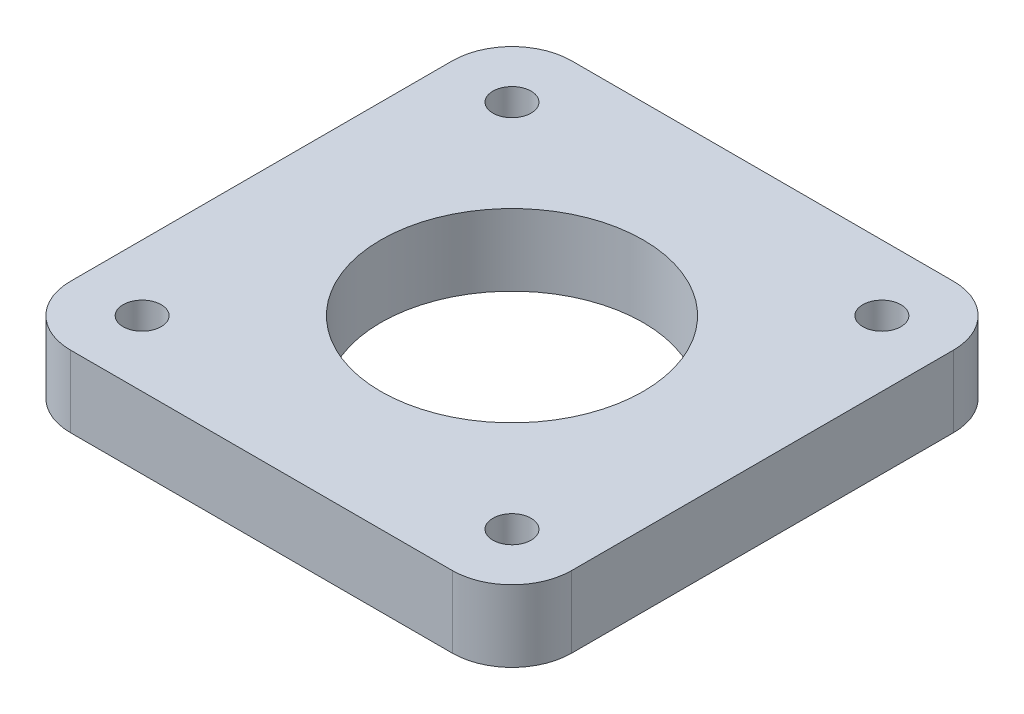
ISO-10303-21;
HEADER;
FILE_DESCRIPTION(('STEP AP214'),'2;1');
FILE_NAME('part.step','',(''),(''),'','','');
FILE_SCHEMA(('AUTOMOTIVE_DESIGN { 1 0 10303 214 1 1 1 1 }'));
ENDSEC;
DATA;
#1=APPLICATION_CONTEXT('core data for automotive mechanical design processes');
#2=APPLICATION_PROTOCOL_DEFINITION('international standard','automotive_design',2000,#1);
#3=PRODUCT_CONTEXT('',#1,'mechanical');
#4=PRODUCT('Part','Part','',(#3));
#5=PRODUCT_RELATED_PRODUCT_CATEGORY('part','',(#4));
#6=PRODUCT_DEFINITION_FORMATION('','',#4);
#7=PRODUCT_DEFINITION_CONTEXT('part definition',#1,'design');
#8=PRODUCT_DEFINITION('design','',#6,#7);
#9=PRODUCT_DEFINITION_SHAPE('','',#8);
#10=(LENGTH_UNIT() NAMED_UNIT(*) SI_UNIT(.MILLI.,.METRE.));
#11=(NAMED_UNIT(*) PLANE_ANGLE_UNIT() SI_UNIT($,.RADIAN.));
#12=(NAMED_UNIT(*) SI_UNIT($,.STERADIAN.) SOLID_ANGLE_UNIT());
#13=UNCERTAINTY_MEASURE_WITH_UNIT(LENGTH_MEASURE(1.E-05),#10,'distance_accuracy_value','');
#14=(GEOMETRIC_REPRESENTATION_CONTEXT(3) GLOBAL_UNCERTAINTY_ASSIGNED_CONTEXT((#13)) GLOBAL_UNIT_ASSIGNED_CONTEXT((#10,
#11,#12)) REPRESENTATION_CONTEXT('',''));
#15=CARTESIAN_POINT('',(0.,0.,0.));
#16=DIRECTION('',(0.,0.,1.));
#17=DIRECTION('',(1.,0.,0.));
#18=AXIS2_PLACEMENT_3D('',#15,#16,#17);
#19=CARTESIAN_POINT('',(21.,6.,-21.));
#20=DIRECTION('',(-1.,0.,0.));
#21=DIRECTION('',(0.,0.,1.));
#22=AXIS2_PLACEMENT_3D('',#19,#20,#21);
#23=PLANE('',#22);
#24=DIRECTION('',(0.,0.,-1.));
#25=VECTOR('',#24,1.);
#26=CARTESIAN_POINT('',(21.,6.,-21.));
#27=LINE('',#26,#25);
#28=CARTESIAN_POINT('',(21.,6.,16.));
#29=VERTEX_POINT('',#28);
#30=CARTESIAN_POINT('',(21.,6.,-16.));
#31=VERTEX_POINT('',#30);
#32=EDGE_CURVE('E118',#29,#31,#27,.T.);
#33=ORIENTED_EDGE('',*,*,#32,.F.);
#34=DIRECTION('',(0.,-1.,0.));
#35=VECTOR('',#34,1.);
#36=CARTESIAN_POINT('',(21.,6.,16.));
#37=LINE('',#36,#35);
#38=CARTESIAN_POINT('',(21.,0.,16.));
#39=VERTEX_POINT('',#38);
#40=EDGE_CURVE('E103',#29,#39,#37,.T.);
#41=ORIENTED_EDGE('',*,*,#40,.T.);
#42=DIRECTION('',(0.,0.,-1.));
#43=VECTOR('',#42,1.);
#44=CARTESIAN_POINT('',(21.,0.,-21.));
#45=LINE('',#44,#43);
#46=CARTESIAN_POINT('',(21.,0.,-16.));
#47=VERTEX_POINT('',#46);
#48=EDGE_CURVE('E115',#39,#47,#45,.T.);
#49=ORIENTED_EDGE('',*,*,#48,.T.);
#50=DIRECTION('',(0.,-1.,0.));
#51=VECTOR('',#50,1.);
#52=CARTESIAN_POINT('',(21.,6.,-16.));
#53=LINE('',#52,#51);
#54=EDGE_CURVE('E120',#47,#31,#53,.F.);
#55=ORIENTED_EDGE('',*,*,#54,.T.);
#56=EDGE_LOOP('',(#33,#41,#49,#55));
#57=FACE_BOUND('',#56,.T.);
#58=ADVANCED_FACE('F33',(#57),#23,.F.);
#59=CARTESIAN_POINT('',(-21.,6.,-21.));
#60=DIRECTION('',(0.,0.,1.));
#61=DIRECTION('',(1.,0.,0.));
#62=AXIS2_PLACEMENT_3D('',#59,#60,#61);
#63=PLANE('',#62);
#64=DIRECTION('',(-1.,0.,0.));
#65=VECTOR('',#64,1.);
#66=CARTESIAN_POINT('',(-21.,0.,-21.));
#67=LINE('',#66,#65);
#68=CARTESIAN_POINT('',(16.,0.,-21.));
#69=VERTEX_POINT('',#68);
#70=CARTESIAN_POINT('',(-16.,0.,-21.));
#71=VERTEX_POINT('',#70);
#72=EDGE_CURVE('E125',#69,#71,#67,.T.);
#73=ORIENTED_EDGE('',*,*,#72,.T.);
#74=DIRECTION('',(0.,-1.,0.));
#75=VECTOR('',#74,1.);
#76=CARTESIAN_POINT('',(-16.,6.,-21.));
#77=LINE('',#76,#75);
#78=CARTESIAN_POINT('',(-16.,6.,-21.));
#79=VERTEX_POINT('',#78);
#80=EDGE_CURVE('E11',#71,#79,#77,.F.);
#81=ORIENTED_EDGE('',*,*,#80,.T.);
#82=DIRECTION('',(-1.,0.,0.));
#83=VECTOR('',#82,1.);
#84=CARTESIAN_POINT('',(-21.,6.,-21.));
#85=LINE('',#84,#83);
#86=CARTESIAN_POINT('',(16.,6.,-21.));
#87=VERTEX_POINT('',#86);
#88=EDGE_CURVE('E164',#87,#79,#85,.T.);
#89=ORIENTED_EDGE('',*,*,#88,.F.);
#90=DIRECTION('',(0.,-1.,0.));
#91=VECTOR('',#90,1.);
#92=CARTESIAN_POINT('',(16.,6.,-21.));
#93=LINE('',#92,#91);
#94=EDGE_CURVE('E41',#87,#69,#93,.T.);
#95=ORIENTED_EDGE('',*,*,#94,.T.);
#96=EDGE_LOOP('',(#73,#81,#89,#95));
#97=FACE_BOUND('',#96,.T.);
#98=ADVANCED_FACE('F162',(#97),#63,.F.);
#99=CARTESIAN_POINT('',(-21.,6.,-21.));
#100=DIRECTION('',(1.,0.,0.));
#101=DIRECTION('',(0.,0.,-1.));
#102=AXIS2_PLACEMENT_3D('',#99,#100,#101);
#103=PLANE('',#102);
#104=DIRECTION('',(0.,0.,1.));
#105=VECTOR('',#104,1.);
#106=CARTESIAN_POINT('',(-21.,6.,-21.));
#107=LINE('',#106,#105);
#108=CARTESIAN_POINT('',(-21.,6.,-16.));
#109=VERTEX_POINT('',#108);
#110=CARTESIAN_POINT('',(-21.,6.,16.));
#111=VERTEX_POINT('',#110);
#112=EDGE_CURVE('E172',#109,#111,#107,.T.);
#113=ORIENTED_EDGE('',*,*,#112,.F.);
#114=DIRECTION('',(0.,-1.,0.));
#115=VECTOR('',#114,1.);
#116=CARTESIAN_POINT('',(-21.,6.,-16.));
#117=LINE('',#116,#115);
#118=CARTESIAN_POINT('',(-21.,0.,-16.));
#119=VERTEX_POINT('',#118);
#120=EDGE_CURVE('E156',#109,#119,#117,.T.);
#121=ORIENTED_EDGE('',*,*,#120,.T.);
#122=DIRECTION('',(0.,0.,1.));
#123=VECTOR('',#122,1.);
#124=CARTESIAN_POINT('',(-21.,0.,-21.));
#125=LINE('',#124,#123);
#126=CARTESIAN_POINT('',(-21.,0.,16.));
#127=VERTEX_POINT('',#126);
#128=EDGE_CURVE('E129',#119,#127,#125,.T.);
#129=ORIENTED_EDGE('',*,*,#128,.T.);
#130=DIRECTION('',(0.,-1.,0.));
#131=VECTOR('',#130,1.);
#132=CARTESIAN_POINT('',(-21.,6.,16.));
#133=LINE('',#132,#131);
#134=EDGE_CURVE('E48',#127,#111,#133,.F.);
#135=ORIENTED_EDGE('',*,*,#134,.T.);
#136=EDGE_LOOP('',(#113,#121,#129,#135));
#137=FACE_BOUND('',#136,.T.);
#138=ADVANCED_FACE('F171',(#137),#103,.F.);
#139=CARTESIAN_POINT('',(-21.,6.,21.));
#140=DIRECTION('',(0.,0.,-1.));
#141=DIRECTION('',(-1.,0.,0.));
#142=AXIS2_PLACEMENT_3D('',#139,#140,#141);
#143=PLANE('',#142);
#144=DIRECTION('',(1.,0.,0.));
#145=VECTOR('',#144,1.);
#146=CARTESIAN_POINT('',(-21.,0.,21.));
#147=LINE('',#146,#145);
#148=CARTESIAN_POINT('',(-16.,0.,21.));
#149=VERTEX_POINT('',#148);
#150=CARTESIAN_POINT('',(16.,0.,21.));
#151=VERTEX_POINT('',#150);
#152=EDGE_CURVE('E139',#149,#151,#147,.T.);
#153=ORIENTED_EDGE('',*,*,#152,.T.);
#154=DIRECTION('',(0.,-1.,0.));
#155=VECTOR('',#154,1.);
#156=CARTESIAN_POINT('',(16.,6.,21.));
#157=LINE('',#156,#155);
#158=CARTESIAN_POINT('',(16.,6.,21.));
#159=VERTEX_POINT('',#158);
#160=EDGE_CURVE('E104',#151,#159,#157,.F.);
#161=ORIENTED_EDGE('',*,*,#160,.T.);
#162=DIRECTION('',(1.,0.,0.));
#163=VECTOR('',#162,1.);
#164=CARTESIAN_POINT('',(-21.,6.,21.));
#165=LINE('',#164,#163);
#166=CARTESIAN_POINT('',(-16.,6.,21.));
#167=VERTEX_POINT('',#166);
#168=EDGE_CURVE('E135',#167,#159,#165,.T.);
#169=ORIENTED_EDGE('',*,*,#168,.F.);
#170=DIRECTION('',(0.,-1.,0.));
#171=VECTOR('',#170,1.);
#172=CARTESIAN_POINT('',(-16.,6.,21.));
#173=LINE('',#172,#171);
#174=EDGE_CURVE('E109',#167,#149,#173,.T.);
#175=ORIENTED_EDGE('',*,*,#174,.T.);
#176=EDGE_LOOP('',(#153,#161,#169,#175));
#177=FACE_BOUND('',#176,.T.);
#178=ADVANCED_FACE('F261',(#177),#143,.F.);
#179=CARTESIAN_POINT('',(0.,6.,0.));
#180=DIRECTION('',(0.,1.,0.));
#181=DIRECTION('',(0.,0.,1.));
#182=AXIS2_PLACEMENT_3D('',#179,#180,#181);
#183=PLANE('',#182);
#184=CARTESIAN_POINT('',(0.,6.00000000000001,0.));
#185=DIRECTION('',(0.,-1.,0.));
#186=DIRECTION('',(0.,0.,-1.));
#187=AXIS2_PLACEMENT_3D('',#184,#185,#186);
#188=CIRCLE('',#187,11.);
#189=CARTESIAN_POINT('',(0.,6.00000000000001,-11.));
#190=VERTEX_POINT('',#189);
#191=EDGE_CURVE('E198',#190,#190,#188,.T.);
#192=ORIENTED_EDGE('',*,*,#191,.T.);
#193=EDGE_LOOP('',(#192));
#194=FACE_BOUND('',#193,.T.);
#195=CARTESIAN_POINT('',(-15.5,6.00000000000001,-15.5));
#196=DIRECTION('',(0.,-1.,0.));
#197=DIRECTION('',(0.,0.,-1.));
#198=AXIS2_PLACEMENT_3D('',#195,#196,#197);
#199=CIRCLE('',#198,1.59999999999999);
#200=CARTESIAN_POINT('',(-15.5,6.00000000000001,-17.1));
#201=VERTEX_POINT('',#200);
#202=EDGE_CURVE('E192',#201,#201,#199,.T.);
#203=ORIENTED_EDGE('',*,*,#202,.T.);
#204=EDGE_LOOP('',(#203));
#205=FACE_BOUND('',#204,.T.);
#206=CARTESIAN_POINT('',(-15.5,6.00000000000001,15.5));
#207=DIRECTION('',(0.,-1.,0.));
#208=DIRECTION('',(0.,0.,-1.));
#209=AXIS2_PLACEMENT_3D('',#206,#207,#208);
#210=CIRCLE('',#209,1.59999999999999);
#211=CARTESIAN_POINT('',(-15.5,6.00000000000001,13.9));
#212=VERTEX_POINT('',#211);
#213=EDGE_CURVE('E186',#212,#212,#210,.T.);
#214=ORIENTED_EDGE('',*,*,#213,.T.);
#215=EDGE_LOOP('',(#214));
#216=FACE_BOUND('',#215,.T.);
#217=CARTESIAN_POINT('',(15.5,6.00000000000001,15.5));
#218=DIRECTION('',(0.,-1.,0.));
#219=DIRECTION('',(0.,0.,-1.));
#220=AXIS2_PLACEMENT_3D('',#217,#218,#219);
#221=CIRCLE('',#220,1.59999999999999);
#222=CARTESIAN_POINT('',(15.5,6.00000000000001,13.9));
#223=VERTEX_POINT('',#222);
#224=EDGE_CURVE('E180',#223,#223,#221,.T.);
#225=ORIENTED_EDGE('',*,*,#224,.T.);
#226=EDGE_LOOP('',(#225));
#227=FACE_BOUND('',#226,.T.);
#228=CARTESIAN_POINT('',(15.5,6.00000000000001,-15.5));
#229=DIRECTION('',(0.,-1.,0.));
#230=DIRECTION('',(0.,0.,-1.));
#231=AXIS2_PLACEMENT_3D('',#228,#229,#230);
#232=CIRCLE('',#231,1.59999999999999);
#233=CARTESIAN_POINT('',(15.5,6.00000000000001,-17.1));
#234=VERTEX_POINT('',#233);
#235=EDGE_CURVE('E126',#234,#234,#232,.T.);
#236=ORIENTED_EDGE('',*,*,#235,.T.);
#237=EDGE_LOOP('',(#236));
#238=FACE_BOUND('',#237,.T.);
#239=ORIENTED_EDGE('',*,*,#168,.T.);
#240=CARTESIAN_POINT('',(16.,6.,16.));
#241=DIRECTION('',(0.,1.,0.));
#242=DIRECTION('',(0.,0.,1.));
#243=AXIS2_PLACEMENT_3D('',#240,#241,#242);
#244=CIRCLE('',#243,5.);
#245=EDGE_CURVE('E153',#159,#29,#244,.T.);
#246=ORIENTED_EDGE('',*,*,#245,.T.);
#247=ORIENTED_EDGE('',*,*,#32,.T.);
#248=CARTESIAN_POINT('',(16.,6.,-16.));
#249=DIRECTION('',(0.,1.,0.));
#250=DIRECTION('',(0.,0.,1.));
#251=AXIS2_PLACEMENT_3D('',#248,#249,#250);
#252=CIRCLE('',#251,5.);
#253=EDGE_CURVE('E150',#31,#87,#252,.T.);
#254=ORIENTED_EDGE('',*,*,#253,.T.);
#255=ORIENTED_EDGE('',*,*,#88,.T.);
#256=CARTESIAN_POINT('',(-16.,6.,-16.));
#257=DIRECTION('',(0.,1.,0.));
#258=DIRECTION('',(0.,0.,1.));
#259=AXIS2_PLACEMENT_3D('',#256,#257,#258);
#260=CIRCLE('',#259,5.);
#261=EDGE_CURVE('E55',#79,#109,#260,.T.);
#262=ORIENTED_EDGE('',*,*,#261,.T.);
#263=ORIENTED_EDGE('',*,*,#112,.T.);
#264=CARTESIAN_POINT('',(-16.,6.,16.));
#265=DIRECTION('',(0.,1.,0.));
#266=DIRECTION('',(0.,0.,1.));
#267=AXIS2_PLACEMENT_3D('',#264,#265,#266);
#268=CIRCLE('',#267,5.);
#269=EDGE_CURVE('E148',#111,#167,#268,.T.);
#270=ORIENTED_EDGE('',*,*,#269,.T.);
#271=EDGE_LOOP('',(#239,#246,#247,#254,#255,#262,#263,#270));
#272=FACE_BOUND('',#271,.T.);
#273=ADVANCED_FACE('F205',(#194,#205,#216,#227,#238,#272),#183,.T.);
#274=CARTESIAN_POINT('',(0.,0.,0.));
#275=DIRECTION('',(0.,1.,0.));
#276=DIRECTION('',(0.,0.,1.));
#277=AXIS2_PLACEMENT_3D('',#274,#275,#276);
#278=PLANE('',#277);
#279=CARTESIAN_POINT('',(0.,0.,0.));
#280=DIRECTION('',(0.,-1.,0.));
#281=DIRECTION('',(0.,0.,-1.));
#282=AXIS2_PLACEMENT_3D('',#279,#280,#281);
#283=CIRCLE('',#282,11.);
#284=CARTESIAN_POINT('',(0.,0.,-11.));
#285=VERTEX_POINT('',#284);
#286=EDGE_CURVE('E199',#285,#285,#283,.T.);
#287=ORIENTED_EDGE('',*,*,#286,.F.);
#288=EDGE_LOOP('',(#287));
#289=FACE_BOUND('',#288,.T.);
#290=CARTESIAN_POINT('',(-15.5,0.,-15.5));
#291=DIRECTION('',(0.,-1.,0.));
#292=DIRECTION('',(0.,0.,-1.));
#293=AXIS2_PLACEMENT_3D('',#290,#291,#292);
#294=CIRCLE('',#293,1.59999999999999);
#295=CARTESIAN_POINT('',(-15.5,0.,-17.1));
#296=VERTEX_POINT('',#295);
#297=EDGE_CURVE('E195',#296,#296,#294,.T.);
#298=ORIENTED_EDGE('',*,*,#297,.F.);
#299=EDGE_LOOP('',(#298));
#300=FACE_BOUND('',#299,.T.);
#301=CARTESIAN_POINT('',(-15.5,0.,15.5));
#302=DIRECTION('',(0.,-1.,0.));
#303=DIRECTION('',(0.,0.,-1.));
#304=AXIS2_PLACEMENT_3D('',#301,#302,#303);
#305=CIRCLE('',#304,1.59999999999999);
#306=CARTESIAN_POINT('',(-15.5,0.,13.9));
#307=VERTEX_POINT('',#306);
#308=EDGE_CURVE('E189',#307,#307,#305,.T.);
#309=ORIENTED_EDGE('',*,*,#308,.F.);
#310=EDGE_LOOP('',(#309));
#311=FACE_BOUND('',#310,.T.);
#312=CARTESIAN_POINT('',(15.5,0.,15.5));
#313=DIRECTION('',(0.,-1.,0.));
#314=DIRECTION('',(0.,0.,-1.));
#315=AXIS2_PLACEMENT_3D('',#312,#313,#314);
#316=CIRCLE('',#315,1.59999999999999);
#317=CARTESIAN_POINT('',(15.5,0.,13.9));
#318=VERTEX_POINT('',#317);
#319=EDGE_CURVE('E183',#318,#318,#316,.T.);
#320=ORIENTED_EDGE('',*,*,#319,.F.);
#321=EDGE_LOOP('',(#320));
#322=FACE_BOUND('',#321,.T.);
#323=CARTESIAN_POINT('',(15.5,0.,-15.5));
#324=DIRECTION('',(0.,-1.,0.));
#325=DIRECTION('',(0.,0.,-1.));
#326=AXIS2_PLACEMENT_3D('',#323,#324,#325);
#327=CIRCLE('',#326,1.59999999999999);
#328=CARTESIAN_POINT('',(15.5,0.,-17.1));
#329=VERTEX_POINT('',#328);
#330=EDGE_CURVE('E132',#329,#329,#327,.T.);
#331=ORIENTED_EDGE('',*,*,#330,.F.);
#332=EDGE_LOOP('',(#331));
#333=FACE_BOUND('',#332,.T.);
#334=ORIENTED_EDGE('',*,*,#48,.F.);
#335=CARTESIAN_POINT('',(16.,0.,16.));
#336=DIRECTION('',(0.,1.,0.));
#337=DIRECTION('',(0.,0.,1.));
#338=AXIS2_PLACEMENT_3D('',#335,#336,#337);
#339=CIRCLE('',#338,5.);
#340=EDGE_CURVE('E99',#39,#151,#339,.F.);
#341=ORIENTED_EDGE('',*,*,#340,.T.);
#342=ORIENTED_EDGE('',*,*,#152,.F.);
#343=CARTESIAN_POINT('',(-16.,0.,16.));
#344=DIRECTION('',(0.,1.,0.));
#345=DIRECTION('',(0.,0.,1.));
#346=AXIS2_PLACEMENT_3D('',#343,#344,#345);
#347=CIRCLE('',#346,5.);
#348=EDGE_CURVE('E119',#149,#127,#347,.F.);
#349=ORIENTED_EDGE('',*,*,#348,.T.);
#350=ORIENTED_EDGE('',*,*,#128,.F.);
#351=CARTESIAN_POINT('',(-16.,0.,-16.));
#352=DIRECTION('',(0.,1.,0.));
#353=DIRECTION('',(0.,0.,1.));
#354=AXIS2_PLACEMENT_3D('',#351,#352,#353);
#355=CIRCLE('',#354,5.);
#356=EDGE_CURVE('E110',#119,#71,#355,.F.);
#357=ORIENTED_EDGE('',*,*,#356,.T.);
#358=ORIENTED_EDGE('',*,*,#72,.F.);
#359=CARTESIAN_POINT('',(16.,0.,-16.));
#360=DIRECTION('',(0.,1.,0.));
#361=DIRECTION('',(0.,0.,1.));
#362=AXIS2_PLACEMENT_3D('',#359,#360,#361);
#363=CIRCLE('',#362,5.);
#364=EDGE_CURVE('E124',#69,#47,#363,.F.);
#365=ORIENTED_EDGE('',*,*,#364,.T.);
#366=EDGE_LOOP('',(#334,#341,#342,#349,#350,#357,#358,#365));
#367=FACE_BOUND('',#366,.T.);
#368=ADVANCED_FACE('F122',(#289,#300,#311,#322,#333,#367),#278,.F.);
#369=CARTESIAN_POINT('',(15.5,0.,-15.5));
#370=DIRECTION('',(0.,-1.,0.));
#371=DIRECTION('',(0.,0.,-1.));
#372=AXIS2_PLACEMENT_3D('',#369,#370,#371);
#373=CYLINDRICAL_SURFACE('',#372,1.59999999999999);
#374=ORIENTED_EDGE('',*,*,#235,.F.);
#375=EDGE_LOOP('',(#374));
#376=FACE_BOUND('',#375,.T.);
#377=ORIENTED_EDGE('',*,*,#330,.T.);
#378=EDGE_LOOP('',(#377));
#379=FACE_BOUND('',#378,.T.);
#380=ADVANCED_FACE('F217',(#376,#379),#373,.F.);
#381=CARTESIAN_POINT('',(15.5,0.,15.5));
#382=DIRECTION('',(0.,-1.,0.));
#383=DIRECTION('',(0.,0.,-1.));
#384=AXIS2_PLACEMENT_3D('',#381,#382,#383);
#385=CYLINDRICAL_SURFACE('',#384,1.59999999999999);
#386=ORIENTED_EDGE('',*,*,#224,.F.);
#387=EDGE_LOOP('',(#386));
#388=FACE_BOUND('',#387,.T.);
#389=ORIENTED_EDGE('',*,*,#319,.T.);
#390=EDGE_LOOP('',(#389));
#391=FACE_BOUND('',#390,.T.);
#392=ADVANCED_FACE('F228',(#388,#391),#385,.F.);
#393=CARTESIAN_POINT('',(-15.5,0.,15.5));
#394=DIRECTION('',(0.,-1.,0.));
#395=DIRECTION('',(0.,0.,-1.));
#396=AXIS2_PLACEMENT_3D('',#393,#394,#395);
#397=CYLINDRICAL_SURFACE('',#396,1.59999999999999);
#398=ORIENTED_EDGE('',*,*,#213,.F.);
#399=EDGE_LOOP('',(#398));
#400=FACE_BOUND('',#399,.T.);
#401=ORIENTED_EDGE('',*,*,#308,.T.);
#402=EDGE_LOOP('',(#401));
#403=FACE_BOUND('',#402,.T.);
#404=ADVANCED_FACE('F235',(#400,#403),#397,.F.);
#405=CARTESIAN_POINT('',(-15.5,0.,-15.5));
#406=DIRECTION('',(0.,-1.,0.));
#407=DIRECTION('',(0.,0.,-1.));
#408=AXIS2_PLACEMENT_3D('',#405,#406,#407);
#409=CYLINDRICAL_SURFACE('',#408,1.59999999999999);
#410=ORIENTED_EDGE('',*,*,#202,.F.);
#411=EDGE_LOOP('',(#410));
#412=FACE_BOUND('',#411,.T.);
#413=ORIENTED_EDGE('',*,*,#297,.T.);
#414=EDGE_LOOP('',(#413));
#415=FACE_BOUND('',#414,.T.);
#416=ADVANCED_FACE('F211',(#412,#415),#409,.F.);
#417=CARTESIAN_POINT('',(0.,6.00000000000001,0.));
#418=DIRECTION('',(0.,-1.,0.));
#419=DIRECTION('',(0.,0.,-1.));
#420=AXIS2_PLACEMENT_3D('',#417,#418,#419);
#421=CYLINDRICAL_SURFACE('',#420,11.);
#422=ORIENTED_EDGE('',*,*,#191,.F.);
#423=EDGE_LOOP('',(#422));
#424=FACE_BOUND('',#423,.T.);
#425=ORIENTED_EDGE('',*,*,#286,.T.);
#426=EDGE_LOOP('',(#425));
#427=FACE_BOUND('',#426,.T.);
#428=ADVANCED_FACE('F208',(#424,#427),#421,.F.);
#429=CARTESIAN_POINT('',(16.,6.,16.));
#430=DIRECTION('',(0.,-1.,0.));
#431=DIRECTION('',(0.,0.,-1.));
#432=AXIS2_PLACEMENT_3D('',#429,#430,#431);
#433=CYLINDRICAL_SURFACE('',#432,5.);
#434=ORIENTED_EDGE('',*,*,#245,.F.);
#435=ORIENTED_EDGE('',*,*,#160,.F.);
#436=ORIENTED_EDGE('',*,*,#340,.F.);
#437=ORIENTED_EDGE('',*,*,#40,.F.);
#438=EDGE_LOOP('',(#434,#435,#436,#437));
#439=FACE_BOUND('',#438,.T.);
#440=ADVANCED_FACE('F102',(#439),#433,.T.);
#441=CARTESIAN_POINT('',(-16.,6.,-16.));
#442=DIRECTION('',(0.,-1.,0.));
#443=DIRECTION('',(0.,0.,-1.));
#444=AXIS2_PLACEMENT_3D('',#441,#442,#443);
#445=CYLINDRICAL_SURFACE('',#444,5.);
#446=ORIENTED_EDGE('',*,*,#261,.F.);
#447=ORIENTED_EDGE('',*,*,#80,.F.);
#448=ORIENTED_EDGE('',*,*,#356,.F.);
#449=ORIENTED_EDGE('',*,*,#120,.F.);
#450=EDGE_LOOP('',(#446,#447,#448,#449));
#451=FACE_BOUND('',#450,.T.);
#452=ADVANCED_FACE('F170',(#451),#445,.T.);
#453=CARTESIAN_POINT('',(16.,6.,-16.));
#454=DIRECTION('',(0.,-1.,0.));
#455=DIRECTION('',(0.,0.,-1.));
#456=AXIS2_PLACEMENT_3D('',#453,#454,#455);
#457=CYLINDRICAL_SURFACE('',#456,5.);
#458=ORIENTED_EDGE('',*,*,#253,.F.);
#459=ORIENTED_EDGE('',*,*,#54,.F.);
#460=ORIENTED_EDGE('',*,*,#364,.F.);
#461=ORIENTED_EDGE('',*,*,#94,.F.);
#462=EDGE_LOOP('',(#458,#459,#460,#461));
#463=FACE_BOUND('',#462,.T.);
#464=ADVANCED_FACE('F252',(#463),#457,.T.);
#465=CARTESIAN_POINT('',(-16.,6.,16.));
#466=DIRECTION('',(0.,-1.,0.));
#467=DIRECTION('',(0.,0.,-1.));
#468=AXIS2_PLACEMENT_3D('',#465,#466,#467);
#469=CYLINDRICAL_SURFACE('',#468,5.);
#470=ORIENTED_EDGE('',*,*,#269,.F.);
#471=ORIENTED_EDGE('',*,*,#134,.F.);
#472=ORIENTED_EDGE('',*,*,#348,.F.);
#473=ORIENTED_EDGE('',*,*,#174,.F.);
#474=EDGE_LOOP('',(#470,#471,#472,#473));
#475=FACE_BOUND('',#474,.T.);
#476=ADVANCED_FACE('F35',(#475),#469,.T.);
#477=CLOSED_SHELL('',(#58,#98,#138,#178,#273,#368,#380,#392,#404,#416,#428,#440,#452,#464,#476));
#478=MANIFOLD_SOLID_BREP('B2',#477);
#479=ADVANCED_BREP_SHAPE_REPRESENTATION('',(#18,#478),#14);
#480=SHAPE_DEFINITION_REPRESENTATION(#9,#479);
ENDSEC;
END-ISO-10303-21;
